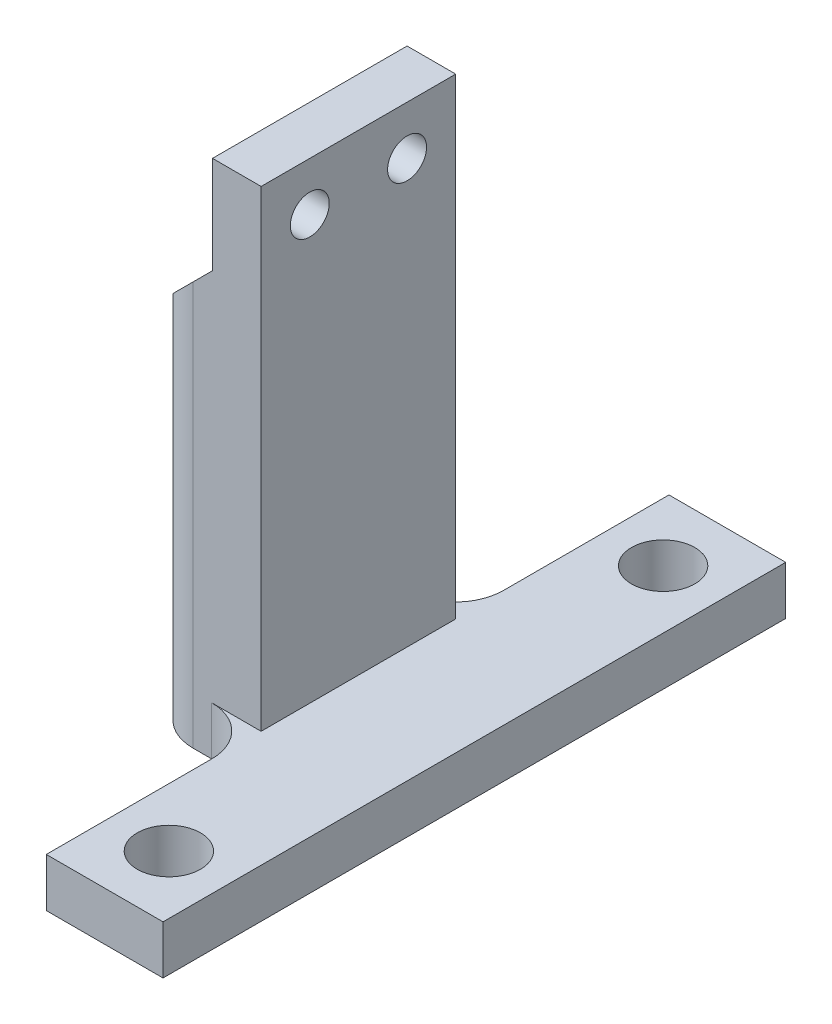
ISO-10303-21;
HEADER;
FILE_DESCRIPTION(('STEP AP214'),'2;1');
FILE_NAME('part.step','',(''),(''),'','','');
FILE_SCHEMA(('AUTOMOTIVE_DESIGN { 1 0 10303 214 1 1 1 1 }'));
ENDSEC;
DATA;
#1=APPLICATION_CONTEXT('core data for automotive mechanical design processes');
#2=APPLICATION_PROTOCOL_DEFINITION('international standard','automotive_design',2000,#1);
#3=PRODUCT_CONTEXT('',#1,'mechanical');
#4=PRODUCT('Part','Part','',(#3));
#5=PRODUCT_RELATED_PRODUCT_CATEGORY('part','',(#4));
#6=PRODUCT_DEFINITION_FORMATION('','',#4);
#7=PRODUCT_DEFINITION_CONTEXT('part definition',#1,'design');
#8=PRODUCT_DEFINITION('design','',#6,#7);
#9=PRODUCT_DEFINITION_SHAPE('','',#8);
#10=(LENGTH_UNIT() NAMED_UNIT(*) SI_UNIT(.MILLI.,.METRE.));
#11=(NAMED_UNIT(*) PLANE_ANGLE_UNIT() SI_UNIT($,.RADIAN.));
#12=(NAMED_UNIT(*) SI_UNIT($,.STERADIAN.) SOLID_ANGLE_UNIT());
#13=UNCERTAINTY_MEASURE_WITH_UNIT(LENGTH_MEASURE(1.E-05),#10,'distance_accuracy_value','');
#14=(GEOMETRIC_REPRESENTATION_CONTEXT(3) GLOBAL_UNCERTAINTY_ASSIGNED_CONTEXT((#13)) GLOBAL_UNIT_ASSIGNED_CONTEXT((#10,
#11,#12)) REPRESENTATION_CONTEXT('',''));
#15=CARTESIAN_POINT('',(0.,0.,0.));
#16=DIRECTION('',(0.,0.,1.));
#17=DIRECTION('',(1.,0.,0.));
#18=AXIS2_PLACEMENT_3D('',#15,#16,#17);
#19=CARTESIAN_POINT('',(7.,0.,0.));
#20=DIRECTION('',(1.,0.,0.));
#21=DIRECTION('',(0.,0.,-1.));
#22=AXIS2_PLACEMENT_3D('',#19,#20,#21);
#23=PLANE('',#22);
#24=CARTESIAN_POINT('',(7.,48.5,-5.));
#25=DIRECTION('',(-1.,0.,0.));
#26=DIRECTION('',(0.,0.,1.));
#27=AXIS2_PLACEMENT_3D('',#24,#25,#26);
#28=CIRCLE('',#27,2.);
#29=CARTESIAN_POINT('',(7.,48.5,-3.));
#30=VERTEX_POINT('',#29);
#31=EDGE_CURVE('E260',#30,#30,#28,.T.);
#32=ORIENTED_EDGE('',*,*,#31,.F.);
#33=EDGE_LOOP('',(#32));
#34=FACE_BOUND('',#33,.T.);
#35=DIRECTION('',(0.,-1.,0.));
#36=VECTOR('',#35,1.);
#37=CARTESIAN_POINT('',(7.,43.5,-10.));
#38=LINE('',#37,#36);
#39=CARTESIAN_POINT('',(7.,53.5,-10.));
#40=VERTEX_POINT('',#39);
#41=CARTESIAN_POINT('',(7.,43.5,-10.));
#42=VERTEX_POINT('',#41);
#43=EDGE_CURVE('E152',#40,#42,#38,.T.);
#44=ORIENTED_EDGE('',*,*,#43,.T.);
#45=DIRECTION('',(0.,0.,1.));
#46=VECTOR('',#45,1.);
#47=CARTESIAN_POINT('',(7.,43.5,-10.));
#48=LINE('',#47,#46);
#49=CARTESIAN_POINT('',(7.,43.5,10.));
#50=VERTEX_POINT('',#49);
#51=EDGE_CURVE('E165',#42,#50,#48,.T.);
#52=ORIENTED_EDGE('',*,*,#51,.T.);
#53=DIRECTION('',(0.,1.,0.));
#54=VECTOR('',#53,1.);
#55=CARTESIAN_POINT('',(7.,43.5,10.));
#56=LINE('',#55,#54);
#57=CARTESIAN_POINT('',(7.,53.5,10.));
#58=VERTEX_POINT('',#57);
#59=EDGE_CURVE('E175',#50,#58,#56,.T.);
#60=ORIENTED_EDGE('',*,*,#59,.T.);
#61=DIRECTION('',(0.,0.,-1.));
#62=VECTOR('',#61,1.);
#63=CARTESIAN_POINT('',(7.,53.5,-10.));
#64=LINE('',#63,#62);
#65=EDGE_CURVE('E168',#58,#40,#64,.T.);
#66=ORIENTED_EDGE('',*,*,#65,.T.);
#67=EDGE_LOOP('',(#44,#52,#60,#66));
#68=FACE_BOUND('',#67,.T.);
#69=CARTESIAN_POINT('',(7.,48.5,5.));
#70=DIRECTION('',(-1.,0.,0.));
#71=DIRECTION('',(0.,0.,1.));
#72=AXIS2_PLACEMENT_3D('',#69,#70,#71);
#73=CIRCLE('',#72,2.);
#74=CARTESIAN_POINT('',(7.,48.5,7.));
#75=VERTEX_POINT('',#74);
#76=EDGE_CURVE('E259',#75,#75,#73,.T.);
#77=ORIENTED_EDGE('',*,*,#76,.F.);
#78=EDGE_LOOP('',(#77));
#79=FACE_BOUND('',#78,.T.);
#80=ADVANCED_FACE('F35',(#34,#68,#79),#23,.F.);
#81=CARTESIAN_POINT('',(0.,5.,0.));
#82=DIRECTION('',(0.,-1.,0.));
#83=DIRECTION('',(0.,0.,-1.));
#84=AXIS2_PLACEMENT_3D('',#81,#82,#83);
#85=PLANE('',#84);
#86=CARTESIAN_POINT('',(17.9171764520374,5.,25.4));
#87=DIRECTION('',(0.,1.,0.));
#88=DIRECTION('',(0.,0.,1.));
#89=AXIS2_PLACEMENT_3D('',#86,#87,#88);
#90=CIRCLE('',#89,3.249999977);
#91=CARTESIAN_POINT('',(17.9171764520374,5.,28.649999977));
#92=VERTEX_POINT('',#91);
#93=EDGE_CURVE('E203',#92,#92,#90,.T.);
#94=ORIENTED_EDGE('',*,*,#93,.F.);
#95=EDGE_LOOP('',(#94));
#96=FACE_BOUND('',#95,.T.);
#97=CARTESIAN_POINT('',(17.9171764520374,5.,-25.4));
#98=DIRECTION('',(0.,1.,0.));
#99=DIRECTION('',(0.,0.,1.));
#100=AXIS2_PLACEMENT_3D('',#97,#98,#99);
#101=CIRCLE('',#100,3.249999977);
#102=CARTESIAN_POINT('',(17.9171764520374,5.,-22.150000023));
#103=VERTEX_POINT('',#102);
#104=EDGE_CURVE('E209',#103,#103,#101,.T.);
#105=ORIENTED_EDGE('',*,*,#104,.F.);
#106=EDGE_LOOP('',(#105));
#107=FACE_BOUND('',#106,.T.);
#108=DIRECTION('',(1.,0.,0.));
#109=VECTOR('',#108,1.);
#110=CARTESIAN_POINT('',(0.,5.,10.));
#111=LINE('',#110,#109);
#112=CARTESIAN_POINT('',(6.91717645203743,5.,10.));
#113=VERTEX_POINT('',#112);
#114=CARTESIAN_POINT('',(12.,5.,10.));
#115=VERTEX_POINT('',#114);
#116=EDGE_CURVE('E194',#113,#115,#111,.T.);
#117=ORIENTED_EDGE('',*,*,#116,.F.);
#118=CARTESIAN_POINT('',(6.91717645203744,5.,15.));
#119=DIRECTION('',(0.,-1.,0.));
#120=DIRECTION('',(0.,0.,-1.));
#121=AXIS2_PLACEMENT_3D('',#118,#119,#120);
#122=CIRCLE('',#121,5.);
#123=CARTESIAN_POINT('',(11.9171764520374,5.,15.));
#124=VERTEX_POINT('',#123);
#125=EDGE_CURVE('E11',#113,#124,#122,.T.);
#126=ORIENTED_EDGE('',*,*,#125,.T.);
#127=DIRECTION('',(0.,0.,1.));
#128=VECTOR('',#127,1.);
#129=CARTESIAN_POINT('',(11.9171764520374,5.,10.));
#130=LINE('',#129,#128);
#131=CARTESIAN_POINT('',(11.9171764520374,5.,32.));
#132=VERTEX_POINT('',#131);
#133=EDGE_CURVE('E226',#124,#132,#130,.T.);
#134=ORIENTED_EDGE('',*,*,#133,.T.);
#135=DIRECTION('',(1.,0.,0.));
#136=VECTOR('',#135,1.);
#137=CARTESIAN_POINT('',(11.9171764520374,5.,32.));
#138=LINE('',#137,#136);
#139=CARTESIAN_POINT('',(23.9171764520374,5.,32.));
#140=VERTEX_POINT('',#139);
#141=EDGE_CURVE('E216',#132,#140,#138,.T.);
#142=ORIENTED_EDGE('',*,*,#141,.T.);
#143=DIRECTION('',(0.,0.,-1.));
#144=VECTOR('',#143,1.);
#145=CARTESIAN_POINT('',(23.9171764520374,5.,-32.));
#146=LINE('',#145,#144);
#147=CARTESIAN_POINT('',(23.9171764520374,5.,-32.));
#148=VERTEX_POINT('',#147);
#149=EDGE_CURVE('E219',#140,#148,#146,.T.);
#150=ORIENTED_EDGE('',*,*,#149,.T.);
#151=DIRECTION('',(-1.,0.,0.));
#152=VECTOR('',#151,1.);
#153=CARTESIAN_POINT('',(11.9171764520374,5.,-32.));
#154=LINE('',#153,#152);
#155=CARTESIAN_POINT('',(11.9171764520374,5.,-32.));
#156=VERTEX_POINT('',#155);
#157=EDGE_CURVE('E222',#148,#156,#154,.T.);
#158=ORIENTED_EDGE('',*,*,#157,.T.);
#159=DIRECTION('',(0.,0.,1.));
#160=VECTOR('',#159,1.);
#161=CARTESIAN_POINT('',(11.9171764520374,5.,-32.));
#162=LINE('',#161,#160);
#163=CARTESIAN_POINT('',(11.9171764520374,5.,-15.));
#164=VERTEX_POINT('',#163);
#165=EDGE_CURVE('E224',#156,#164,#162,.T.);
#166=ORIENTED_EDGE('',*,*,#165,.T.);
#167=CARTESIAN_POINT('',(6.91717645203743,5.,-15.));
#168=DIRECTION('',(0.,-1.,0.));
#169=DIRECTION('',(0.,0.,-1.));
#170=AXIS2_PLACEMENT_3D('',#167,#168,#169);
#171=CIRCLE('',#170,5.);
#172=CARTESIAN_POINT('',(6.91717645203743,5.,-10.));
#173=VERTEX_POINT('',#172);
#174=EDGE_CURVE('E292',#164,#173,#171,.T.);
#175=ORIENTED_EDGE('',*,*,#174,.T.);
#176=DIRECTION('',(-1.,0.,0.));
#177=VECTOR('',#176,1.);
#178=CARTESIAN_POINT('',(12.,5.,-10.));
#179=LINE('',#178,#177);
#180=CARTESIAN_POINT('',(12.,5.,-10.));
#181=VERTEX_POINT('',#180);
#182=EDGE_CURVE('E186',#181,#173,#179,.T.);
#183=ORIENTED_EDGE('',*,*,#182,.F.);
#184=DIRECTION('',(0.,0.,-1.));
#185=VECTOR('',#184,1.);
#186=CARTESIAN_POINT('',(12.,5.,10.));
#187=LINE('',#186,#185);
#188=EDGE_CURVE('E181',#115,#181,#187,.T.);
#189=ORIENTED_EDGE('',*,*,#188,.F.);
#190=EDGE_LOOP('',(#117,#126,#134,#142,#150,#158,#166,#175,#183,#189));
#191=FACE_BOUND('',#190,.T.);
#192=ADVANCED_FACE('F309',(#96,#107,#191),#85,.F.);
#193=CARTESIAN_POINT('',(11.9171764520374,5.,32.));
#194=DIRECTION('',(0.,0.,-1.));
#195=DIRECTION('',(-1.,0.,0.));
#196=AXIS2_PLACEMENT_3D('',#193,#194,#195);
#197=PLANE('',#196);
#198=DIRECTION('',(1.,0.,0.));
#199=VECTOR('',#198,1.);
#200=CARTESIAN_POINT('',(11.9171764520374,0.,32.));
#201=LINE('',#200,#199);
#202=CARTESIAN_POINT('',(11.9171764520374,0.,32.));
#203=VERTEX_POINT('',#202);
#204=CARTESIAN_POINT('',(23.9171764520374,0.,32.));
#205=VERTEX_POINT('',#204);
#206=EDGE_CURVE('E215',#203,#205,#201,.T.);
#207=ORIENTED_EDGE('',*,*,#206,.T.);
#208=DIRECTION('',(0.,-1.,0.));
#209=VECTOR('',#208,1.);
#210=CARTESIAN_POINT('',(23.9171764520374,5.,32.));
#211=LINE('',#210,#209);
#212=EDGE_CURVE('E197',#140,#205,#211,.T.);
#213=ORIENTED_EDGE('',*,*,#212,.F.);
#214=ORIENTED_EDGE('',*,*,#141,.F.);
#215=DIRECTION('',(0.,-1.,0.));
#216=VECTOR('',#215,1.);
#217=CARTESIAN_POINT('',(11.9171764520374,5.,32.));
#218=LINE('',#217,#216);
#219=EDGE_CURVE('E228',#132,#203,#218,.T.);
#220=ORIENTED_EDGE('',*,*,#219,.T.);
#221=EDGE_LOOP('',(#207,#213,#214,#220));
#222=FACE_BOUND('',#221,.T.);
#223=ADVANCED_FACE('F313',(#222),#197,.F.);
#224=CARTESIAN_POINT('',(23.9171764520374,5.,-32.));
#225=DIRECTION('',(-1.,0.,0.));
#226=DIRECTION('',(0.,0.,1.));
#227=AXIS2_PLACEMENT_3D('',#224,#225,#226);
#228=PLANE('',#227);
#229=DIRECTION('',(0.,0.,-1.));
#230=VECTOR('',#229,1.);
#231=CARTESIAN_POINT('',(23.9171764520374,0.,-32.));
#232=LINE('',#231,#230);
#233=CARTESIAN_POINT('',(23.9171764520374,0.,-32.));
#234=VERTEX_POINT('',#233);
#235=EDGE_CURVE('E231',#205,#234,#232,.T.);
#236=ORIENTED_EDGE('',*,*,#235,.T.);
#237=DIRECTION('',(0.,-1.,0.));
#238=VECTOR('',#237,1.);
#239=CARTESIAN_POINT('',(23.9171764520374,5.,-32.));
#240=LINE('',#239,#238);
#241=EDGE_CURVE('E251',#148,#234,#240,.T.);
#242=ORIENTED_EDGE('',*,*,#241,.F.);
#243=ORIENTED_EDGE('',*,*,#149,.F.);
#244=ORIENTED_EDGE('',*,*,#212,.T.);
#245=EDGE_LOOP('',(#236,#242,#243,#244));
#246=FACE_BOUND('',#245,.T.);
#247=ADVANCED_FACE('F315',(#246),#228,.F.);
#248=CARTESIAN_POINT('',(11.9171764520374,5.,-32.));
#249=DIRECTION('',(0.,0.,1.));
#250=DIRECTION('',(1.,0.,0.));
#251=AXIS2_PLACEMENT_3D('',#248,#249,#250);
#252=PLANE('',#251);
#253=DIRECTION('',(-1.,0.,0.));
#254=VECTOR('',#253,1.);
#255=CARTESIAN_POINT('',(11.9171764520374,0.,-32.));
#256=LINE('',#255,#254);
#257=CARTESIAN_POINT('',(11.9171764520374,0.,-32.));
#258=VERTEX_POINT('',#257);
#259=EDGE_CURVE('E233',#234,#258,#256,.T.);
#260=ORIENTED_EDGE('',*,*,#259,.T.);
#261=DIRECTION('',(0.,-1.,0.));
#262=VECTOR('',#261,1.);
#263=CARTESIAN_POINT('',(11.9171764520374,5.,-32.));
#264=LINE('',#263,#262);
#265=EDGE_CURVE('E248',#156,#258,#264,.T.);
#266=ORIENTED_EDGE('',*,*,#265,.F.);
#267=ORIENTED_EDGE('',*,*,#157,.F.);
#268=ORIENTED_EDGE('',*,*,#241,.T.);
#269=EDGE_LOOP('',(#260,#266,#267,#268));
#270=FACE_BOUND('',#269,.T.);
#271=ADVANCED_FACE('F320',(#270),#252,.F.);
#272=CARTESIAN_POINT('',(11.9171764520374,5.,-32.));
#273=DIRECTION('',(1.,0.,0.));
#274=DIRECTION('',(0.,0.,-1.));
#275=AXIS2_PLACEMENT_3D('',#272,#273,#274);
#276=PLANE('',#275);
#277=DIRECTION('',(0.,0.,1.));
#278=VECTOR('',#277,1.);
#279=CARTESIAN_POINT('',(11.9171764520374,0.,-32.));
#280=LINE('',#279,#278);
#281=CARTESIAN_POINT('',(11.9171764520374,0.,-15.));
#282=VERTEX_POINT('',#281);
#283=EDGE_CURVE('E235',#258,#282,#280,.T.);
#284=ORIENTED_EDGE('',*,*,#283,.T.);
#285=DIRECTION('',(0.,-1.,0.));
#286=VECTOR('',#285,1.);
#287=CARTESIAN_POINT('',(11.9171764520374,5.,-15.));
#288=LINE('',#287,#286);
#289=EDGE_CURVE('E56',#282,#164,#288,.F.);
#290=ORIENTED_EDGE('',*,*,#289,.T.);
#291=ORIENTED_EDGE('',*,*,#165,.F.);
#292=ORIENTED_EDGE('',*,*,#265,.T.);
#293=EDGE_LOOP('',(#284,#290,#291,#292));
#294=FACE_BOUND('',#293,.T.);
#295=ADVANCED_FACE('F386',(#294),#276,.F.);
#296=CARTESIAN_POINT('',(11.9171764520374,5.,-10.));
#297=DIRECTION('',(0.,0.,1.));
#298=DIRECTION('',(1.,0.,0.));
#299=AXIS2_PLACEMENT_3D('',#296,#297,#298);
#300=PLANE('',#299);
#301=DIRECTION('',(-1.,0.,0.));
#302=VECTOR('',#301,1.);
#303=CARTESIAN_POINT('',(11.9171764520374,0.,-10.));
#304=LINE('',#303,#302);
#305=CARTESIAN_POINT('',(6.91717645203743,0.,-10.));
#306=VERTEX_POINT('',#305);
#307=CARTESIAN_POINT('',(5.,0.,-10.));
#308=VERTEX_POINT('',#307);
#309=EDGE_CURVE('E237',#306,#308,#304,.T.);
#310=ORIENTED_EDGE('',*,*,#309,.T.);
#311=DIRECTION('',(0.,-1.,0.));
#312=VECTOR('',#311,1.);
#313=CARTESIAN_POINT('',(5.,5.,-10.));
#314=LINE('',#313,#312);
#315=CARTESIAN_POINT('',(4.99999999999999,41.5,-10.));
#316=VERTEX_POINT('',#315);
#317=EDGE_CURVE('E155',#308,#316,#314,.F.);
#318=ORIENTED_EDGE('',*,*,#317,.T.);
#319=DIRECTION('',(-0.707106781186546,-0.707106781186549,0.));
#320=VECTOR('',#319,1.);
#321=CARTESIAN_POINT('',(7.,43.5,-10.));
#322=LINE('',#321,#320);
#323=EDGE_CURVE('E148',#316,#42,#322,.F.);
#324=ORIENTED_EDGE('',*,*,#323,.T.);
#325=ORIENTED_EDGE('',*,*,#43,.F.);
#326=DIRECTION('',(-1.,0.,0.));
#327=VECTOR('',#326,1.);
#328=CARTESIAN_POINT('',(12.,53.5,-10.));
#329=LINE('',#328,#327);
#330=CARTESIAN_POINT('',(12.,53.5,-10.));
#331=VERTEX_POINT('',#330);
#332=EDGE_CURVE('E185',#331,#40,#329,.T.);
#333=ORIENTED_EDGE('',*,*,#332,.F.);
#334=DIRECTION('',(0.,-1.,0.));
#335=VECTOR('',#334,1.);
#336=CARTESIAN_POINT('',(12.,53.5,-10.));
#337=LINE('',#336,#335);
#338=EDGE_CURVE('E200',#331,#181,#337,.T.);
#339=ORIENTED_EDGE('',*,*,#338,.T.);
#340=ORIENTED_EDGE('',*,*,#182,.T.);
#341=DIRECTION('',(0.,-1.,0.));
#342=VECTOR('',#341,1.);
#343=CARTESIAN_POINT('',(6.91717645203743,0.,-10.));
#344=LINE('',#343,#342);
#345=EDGE_CURVE('E282',#173,#306,#344,.T.);
#346=ORIENTED_EDGE('',*,*,#345,.T.);
#347=EDGE_LOOP('',(#310,#318,#324,#325,#333,#339,#340,#346));
#348=FACE_BOUND('',#347,.T.);
#349=ADVANCED_FACE('F151',(#348),#300,.F.);
#350=CARTESIAN_POINT('',(0.,5.,10.));
#351=DIRECTION('',(1.,0.,0.));
#352=DIRECTION('',(0.,0.,-1.));
#353=AXIS2_PLACEMENT_3D('',#350,#351,#352);
#354=PLANE('',#353);
#355=DIRECTION('',(0.,0.,1.));
#356=VECTOR('',#355,1.);
#357=CARTESIAN_POINT('',(0.,0.,10.));
#358=LINE('',#357,#356);
#359=CARTESIAN_POINT('',(0.,0.,-5.));
#360=VERTEX_POINT('',#359);
#361=CARTESIAN_POINT('',(0.,0.,5.));
#362=VERTEX_POINT('',#361);
#363=EDGE_CURVE('E239',#360,#362,#358,.T.);
#364=ORIENTED_EDGE('',*,*,#363,.T.);
#365=DIRECTION('',(0.,-1.,0.));
#366=VECTOR('',#365,1.);
#367=CARTESIAN_POINT('',(0.,5.,5.));
#368=LINE('',#367,#366);
#369=CARTESIAN_POINT('',(0.,36.5,5.));
#370=VERTEX_POINT('',#369);
#371=EDGE_CURVE('E276',#362,#370,#368,.F.);
#372=ORIENTED_EDGE('',*,*,#371,.T.);
#373=DIRECTION('',(0.,0.,-1.));
#374=VECTOR('',#373,1.);
#375=CARTESIAN_POINT('',(0.,36.5,10.));
#376=LINE('',#375,#374);
#377=CARTESIAN_POINT('',(0.,36.5,-5.));
#378=VERTEX_POINT('',#377);
#379=EDGE_CURVE('E160',#370,#378,#376,.T.);
#380=ORIENTED_EDGE('',*,*,#379,.T.);
#381=DIRECTION('',(0.,-1.,0.));
#382=VECTOR('',#381,1.);
#383=CARTESIAN_POINT('',(0.,5.,-5.));
#384=LINE('',#383,#382);
#385=EDGE_CURVE('E273',#378,#360,#384,.T.);
#386=ORIENTED_EDGE('',*,*,#385,.T.);
#387=EDGE_LOOP('',(#364,#372,#380,#386));
#388=FACE_BOUND('',#387,.T.);
#389=ADVANCED_FACE('F332',(#388),#354,.F.);
#390=CARTESIAN_POINT('',(11.9171764520374,5.,10.));
#391=DIRECTION('',(0.,0.,-1.));
#392=DIRECTION('',(-1.,0.,0.));
#393=AXIS2_PLACEMENT_3D('',#390,#391,#392);
#394=PLANE('',#393);
#395=DIRECTION('',(0.707106781186546,0.707106781186549,0.));
#396=VECTOR('',#395,1.);
#397=CARTESIAN_POINT('',(7.00000000000001,43.5,10.));
#398=LINE('',#397,#396);
#399=CARTESIAN_POINT('',(5.,41.5,10.));
#400=VERTEX_POINT('',#399);
#401=EDGE_CURVE('E174',#50,#400,#398,.F.);
#402=ORIENTED_EDGE('',*,*,#401,.T.);
#403=DIRECTION('',(0.,-1.,0.));
#404=VECTOR('',#403,1.);
#405=CARTESIAN_POINT('',(5.,5.,10.));
#406=LINE('',#405,#404);
#407=CARTESIAN_POINT('',(5.,0.,10.));
#408=VERTEX_POINT('',#407);
#409=EDGE_CURVE('E266',#400,#408,#406,.T.);
#410=ORIENTED_EDGE('',*,*,#409,.T.);
#411=DIRECTION('',(1.,0.,0.));
#412=VECTOR('',#411,1.);
#413=CARTESIAN_POINT('',(11.9171764520374,0.,10.));
#414=LINE('',#413,#412);
#415=CARTESIAN_POINT('',(6.91717645203743,0.,10.));
#416=VERTEX_POINT('',#415);
#417=EDGE_CURVE('E242',#408,#416,#414,.T.);
#418=ORIENTED_EDGE('',*,*,#417,.T.);
#419=DIRECTION('',(0.,-1.,0.));
#420=VECTOR('',#419,1.);
#421=CARTESIAN_POINT('',(6.91717645203743,5.,10.));
#422=LINE('',#421,#420);
#423=EDGE_CURVE('E159',#416,#113,#422,.F.);
#424=ORIENTED_EDGE('',*,*,#423,.T.);
#425=ORIENTED_EDGE('',*,*,#116,.T.);
#426=DIRECTION('',(0.,-1.,0.));
#427=VECTOR('',#426,1.);
#428=CARTESIAN_POINT('',(12.,53.5,10.));
#429=LINE('',#428,#427);
#430=CARTESIAN_POINT('',(12.,53.5,10.));
#431=VERTEX_POINT('',#430);
#432=EDGE_CURVE('E190',#431,#115,#429,.T.);
#433=ORIENTED_EDGE('',*,*,#432,.F.);
#434=DIRECTION('',(1.,0.,0.));
#435=VECTOR('',#434,1.);
#436=CARTESIAN_POINT('',(0.,53.5,10.));
#437=LINE('',#436,#435);
#438=EDGE_CURVE('E188',#58,#431,#437,.T.);
#439=ORIENTED_EDGE('',*,*,#438,.F.);
#440=ORIENTED_EDGE('',*,*,#59,.F.);
#441=EDGE_LOOP('',(#402,#410,#418,#424,#425,#433,#439,#440));
#442=FACE_BOUND('',#441,.T.);
#443=ADVANCED_FACE('F303',(#442),#394,.F.);
#444=CARTESIAN_POINT('',(11.9171764520374,5.,10.));
#445=DIRECTION('',(1.,0.,0.));
#446=DIRECTION('',(0.,0.,-1.));
#447=AXIS2_PLACEMENT_3D('',#444,#445,#446);
#448=PLANE('',#447);
#449=ORIENTED_EDGE('',*,*,#133,.F.);
#450=DIRECTION('',(0.,-1.,0.));
#451=VECTOR('',#450,1.);
#452=CARTESIAN_POINT('',(11.9171764520374,0.,15.));
#453=LINE('',#452,#451);
#454=CARTESIAN_POINT('',(11.9171764520374,0.,15.));
#455=VERTEX_POINT('',#454);
#456=EDGE_CURVE('E287',#124,#455,#453,.T.);
#457=ORIENTED_EDGE('',*,*,#456,.T.);
#458=DIRECTION('',(0.,0.,1.));
#459=VECTOR('',#458,1.);
#460=CARTESIAN_POINT('',(11.9171764520374,0.,10.));
#461=LINE('',#460,#459);
#462=EDGE_CURVE('E220',#455,#203,#461,.T.);
#463=ORIENTED_EDGE('',*,*,#462,.T.);
#464=ORIENTED_EDGE('',*,*,#219,.F.);
#465=EDGE_LOOP('',(#449,#457,#463,#464));
#466=FACE_BOUND('',#465,.T.);
#467=ADVANCED_FACE('F306',(#466),#448,.F.);
#468=CARTESIAN_POINT('',(0.,0.,0.));
#469=DIRECTION('',(0.,-1.,0.));
#470=DIRECTION('',(0.,0.,-1.));
#471=AXIS2_PLACEMENT_3D('',#468,#469,#470);
#472=PLANE('',#471);
#473=CARTESIAN_POINT('',(17.9171764520374,0.,25.4));
#474=DIRECTION('',(0.,1.,0.));
#475=DIRECTION('',(0.,0.,1.));
#476=AXIS2_PLACEMENT_3D('',#473,#474,#475);
#477=CIRCLE('',#476,3.249999977);
#478=CARTESIAN_POINT('',(17.9171764520374,0.,28.649999977));
#479=VERTEX_POINT('',#478);
#480=EDGE_CURVE('E206',#479,#479,#477,.T.);
#481=ORIENTED_EDGE('',*,*,#480,.T.);
#482=EDGE_LOOP('',(#481));
#483=FACE_BOUND('',#482,.T.);
#484=CARTESIAN_POINT('',(17.9171764520374,0.,-25.4));
#485=DIRECTION('',(0.,1.,0.));
#486=DIRECTION('',(0.,0.,1.));
#487=AXIS2_PLACEMENT_3D('',#484,#485,#486);
#488=CIRCLE('',#487,3.249999977);
#489=CARTESIAN_POINT('',(17.9171764520374,0.,-22.150000023));
#490=VERTEX_POINT('',#489);
#491=EDGE_CURVE('E212',#490,#490,#488,.T.);
#492=ORIENTED_EDGE('',*,*,#491,.T.);
#493=EDGE_LOOP('',(#492));
#494=FACE_BOUND('',#493,.T.);
#495=ORIENTED_EDGE('',*,*,#417,.F.);
#496=CARTESIAN_POINT('',(5.,0.,5.));
#497=DIRECTION('',(0.,-1.,0.));
#498=DIRECTION('',(0.,0.,-1.));
#499=AXIS2_PLACEMENT_3D('',#496,#497,#498);
#500=CIRCLE('',#499,5.);
#501=EDGE_CURVE('E271',#408,#362,#500,.T.);
#502=ORIENTED_EDGE('',*,*,#501,.T.);
#503=ORIENTED_EDGE('',*,*,#363,.F.);
#504=CARTESIAN_POINT('',(5.,0.,-5.));
#505=DIRECTION('',(0.,-1.,0.));
#506=DIRECTION('',(0.,0.,-1.));
#507=AXIS2_PLACEMENT_3D('',#504,#505,#506);
#508=CIRCLE('',#507,5.);
#509=EDGE_CURVE('E269',#360,#308,#508,.T.);
#510=ORIENTED_EDGE('',*,*,#509,.T.);
#511=ORIENTED_EDGE('',*,*,#309,.F.);
#512=CARTESIAN_POINT('',(6.91717645203743,0.,-15.));
#513=DIRECTION('',(0.,-1.,0.));
#514=DIRECTION('',(0.,0.,-1.));
#515=AXIS2_PLACEMENT_3D('',#512,#513,#514);
#516=CIRCLE('',#515,5.);
#517=EDGE_CURVE('E290',#306,#282,#516,.F.);
#518=ORIENTED_EDGE('',*,*,#517,.T.);
#519=ORIENTED_EDGE('',*,*,#283,.F.);
#520=ORIENTED_EDGE('',*,*,#259,.F.);
#521=ORIENTED_EDGE('',*,*,#235,.F.);
#522=ORIENTED_EDGE('',*,*,#206,.F.);
#523=ORIENTED_EDGE('',*,*,#462,.F.);
#524=CARTESIAN_POINT('',(6.91717645203744,0.,15.));
#525=DIRECTION('',(0.,-1.,0.));
#526=DIRECTION('',(0.,0.,-1.));
#527=AXIS2_PLACEMENT_3D('',#524,#525,#526);
#528=CIRCLE('',#527,5.);
#529=EDGE_CURVE('E43',#455,#416,#528,.F.);
#530=ORIENTED_EDGE('',*,*,#529,.T.);
#531=EDGE_LOOP('',(#495,#502,#503,#510,#511,#518,#519,#520,#521,#522,#523,#530));
#532=FACE_BOUND('',#531,.T.);
#533=ADVANCED_FACE('F297',(#483,#494,#532),#472,.T.);
#534=CARTESIAN_POINT('',(17.9171764520374,5.,-25.4));
#535=DIRECTION('',(0.,1.,0.));
#536=DIRECTION('',(0.,0.,1.));
#537=AXIS2_PLACEMENT_3D('',#534,#535,#536);
#538=CYLINDRICAL_SURFACE('',#537,3.249999977);
#539=ORIENTED_EDGE('',*,*,#491,.F.);
#540=EDGE_LOOP('',(#539));
#541=FACE_BOUND('',#540,.T.);
#542=ORIENTED_EDGE('',*,*,#104,.T.);
#543=EDGE_LOOP('',(#542));
#544=FACE_BOUND('',#543,.T.);
#545=ADVANCED_FACE('F370',(#541,#544),#538,.F.);
#546=CARTESIAN_POINT('',(17.9171764520374,5.,25.4));
#547=DIRECTION('',(0.,1.,0.));
#548=DIRECTION('',(0.,0.,1.));
#549=AXIS2_PLACEMENT_3D('',#546,#547,#548);
#550=CYLINDRICAL_SURFACE('',#549,3.249999977);
#551=ORIENTED_EDGE('',*,*,#480,.F.);
#552=EDGE_LOOP('',(#551));
#553=FACE_BOUND('',#552,.T.);
#554=ORIENTED_EDGE('',*,*,#93,.T.);
#555=EDGE_LOOP('',(#554));
#556=FACE_BOUND('',#555,.T.);
#557=ADVANCED_FACE('F366',(#553,#556),#550,.F.);
#558=CARTESIAN_POINT('',(12.,53.5,10.));
#559=DIRECTION('',(-1.,0.,0.));
#560=DIRECTION('',(0.,0.,1.));
#561=AXIS2_PLACEMENT_3D('',#558,#559,#560);
#562=PLANE('',#561);
#563=CARTESIAN_POINT('',(12.,48.5,-5.));
#564=DIRECTION('',(-1.,0.,0.));
#565=DIRECTION('',(0.,0.,1.));
#566=AXIS2_PLACEMENT_3D('',#563,#564,#565);
#567=CIRCLE('',#566,2.);
#568=CARTESIAN_POINT('',(12.,48.5,-3.));
#569=VERTEX_POINT('',#568);
#570=EDGE_CURVE('E256',#569,#569,#567,.T.);
#571=ORIENTED_EDGE('',*,*,#570,.T.);
#572=EDGE_LOOP('',(#571));
#573=FACE_BOUND('',#572,.T.);
#574=CARTESIAN_POINT('',(12.,48.5,5.));
#575=DIRECTION('',(-1.,0.,0.));
#576=DIRECTION('',(0.,0.,1.));
#577=AXIS2_PLACEMENT_3D('',#574,#575,#576);
#578=CIRCLE('',#577,2.);
#579=CARTESIAN_POINT('',(12.,48.5,7.));
#580=VERTEX_POINT('',#579);
#581=EDGE_CURVE('E169',#580,#580,#578,.T.);
#582=ORIENTED_EDGE('',*,*,#581,.T.);
#583=EDGE_LOOP('',(#582));
#584=FACE_BOUND('',#583,.T.);
#585=ORIENTED_EDGE('',*,*,#188,.T.);
#586=ORIENTED_EDGE('',*,*,#338,.F.);
#587=DIRECTION('',(0.,0.,-1.));
#588=VECTOR('',#587,1.);
#589=CARTESIAN_POINT('',(12.,53.5,10.));
#590=LINE('',#589,#588);
#591=EDGE_CURVE('E182',#431,#331,#590,.T.);
#592=ORIENTED_EDGE('',*,*,#591,.F.);
#593=ORIENTED_EDGE('',*,*,#432,.T.);
#594=EDGE_LOOP('',(#585,#586,#592,#593));
#595=FACE_BOUND('',#594,.T.);
#596=ADVANCED_FACE('F362',(#573,#584,#595),#562,.F.);
#597=CARTESIAN_POINT('',(0.,53.5,0.));
#598=DIRECTION('',(0.,1.,0.));
#599=DIRECTION('',(0.,0.,1.));
#600=AXIS2_PLACEMENT_3D('',#597,#598,#599);
#601=PLANE('',#600);
#602=ORIENTED_EDGE('',*,*,#65,.F.);
#603=ORIENTED_EDGE('',*,*,#438,.T.);
#604=ORIENTED_EDGE('',*,*,#591,.T.);
#605=ORIENTED_EDGE('',*,*,#332,.T.);
#606=EDGE_LOOP('',(#602,#603,#604,#605));
#607=FACE_BOUND('',#606,.T.);
#608=ADVANCED_FACE('F359',(#607),#601,.T.);
#609=CARTESIAN_POINT('',(7.,48.5,5.));
#610=DIRECTION('',(-1.,0.,0.));
#611=DIRECTION('',(0.,0.,1.));
#612=AXIS2_PLACEMENT_3D('',#609,#610,#611);
#613=CYLINDRICAL_SURFACE('',#612,2.);
#614=ORIENTED_EDGE('',*,*,#76,.T.);
#615=EDGE_LOOP('',(#614));
#616=FACE_BOUND('',#615,.T.);
#617=ORIENTED_EDGE('',*,*,#581,.F.);
#618=EDGE_LOOP('',(#617));
#619=FACE_BOUND('',#618,.T.);
#620=ADVANCED_FACE('F357',(#616,#619),#613,.F.);
#621=CARTESIAN_POINT('',(7.,48.5,-5.));
#622=DIRECTION('',(-1.,0.,0.));
#623=DIRECTION('',(0.,0.,1.));
#624=AXIS2_PLACEMENT_3D('',#621,#622,#623);
#625=CYLINDRICAL_SURFACE('',#624,2.);
#626=ORIENTED_EDGE('',*,*,#31,.T.);
#627=EDGE_LOOP('',(#626));
#628=FACE_BOUND('',#627,.T.);
#629=ORIENTED_EDGE('',*,*,#570,.F.);
#630=EDGE_LOOP('',(#629));
#631=FACE_BOUND('',#630,.T.);
#632=ADVANCED_FACE('F344',(#628,#631),#625,.F.);
#633=CARTESIAN_POINT('',(7.,43.5,-10.));
#634=DIRECTION('',(0.707106781186549,-0.707106781186546,0.));
#635=DIRECTION('',(0.,0.,1.));
#636=AXIS2_PLACEMENT_3D('',#633,#634,#635);
#637=PLANE('',#636);
#638=ORIENTED_EDGE('',*,*,#379,.F.);
#639=CARTESIAN_POINT('',(5.,41.5,5.));
#640=DIRECTION('',(0.707106781186549,-0.707106781186546,0.));
#641=DIRECTION('',(-0.707106781186546,-0.707106781186549,0.));
#642=AXIS2_PLACEMENT_3D('',#639,#640,#641);
#643=ELLIPSE('',#642,7.07106781186549,5.);
#644=EDGE_CURVE('E280',#370,#400,#643,.F.);
#645=ORIENTED_EDGE('',*,*,#644,.T.);
#646=ORIENTED_EDGE('',*,*,#401,.F.);
#647=ORIENTED_EDGE('',*,*,#51,.F.);
#648=ORIENTED_EDGE('',*,*,#323,.F.);
#649=CARTESIAN_POINT('',(5.,41.5,-5.));
#650=DIRECTION('',(0.707106781186549,-0.707106781186546,0.));
#651=DIRECTION('',(-0.707106781186546,-0.707106781186549,0.));
#652=AXIS2_PLACEMENT_3D('',#649,#650,#651);
#653=ELLIPSE('',#652,7.07106781186549,5.);
#654=EDGE_CURVE('E278',#316,#378,#653,.F.);
#655=ORIENTED_EDGE('',*,*,#654,.T.);
#656=EDGE_LOOP('',(#638,#645,#646,#647,#648,#655));
#657=FACE_BOUND('',#656,.T.);
#658=ADVANCED_FACE('F172',(#657),#637,.F.);
#659=CARTESIAN_POINT('',(5.,5.,5.));
#660=DIRECTION('',(0.,-1.,0.));
#661=DIRECTION('',(0.,0.,-1.));
#662=AXIS2_PLACEMENT_3D('',#659,#660,#661);
#663=CYLINDRICAL_SURFACE('',#662,5.);
#664=ORIENTED_EDGE('',*,*,#644,.F.);
#665=ORIENTED_EDGE('',*,*,#371,.F.);
#666=ORIENTED_EDGE('',*,*,#501,.F.);
#667=ORIENTED_EDGE('',*,*,#409,.F.);
#668=EDGE_LOOP('',(#664,#665,#666,#667));
#669=FACE_BOUND('',#668,.T.);
#670=ADVANCED_FACE('F336',(#669),#663,.T.);
#671=CARTESIAN_POINT('',(5.,5.,-5.));
#672=DIRECTION('',(0.,-1.,0.));
#673=DIRECTION('',(0.,0.,-1.));
#674=AXIS2_PLACEMENT_3D('',#671,#672,#673);
#675=CYLINDRICAL_SURFACE('',#674,5.);
#676=ORIENTED_EDGE('',*,*,#654,.F.);
#677=ORIENTED_EDGE('',*,*,#317,.F.);
#678=ORIENTED_EDGE('',*,*,#509,.F.);
#679=ORIENTED_EDGE('',*,*,#385,.F.);
#680=EDGE_LOOP('',(#676,#677,#678,#679));
#681=FACE_BOUND('',#680,.T.);
#682=ADVANCED_FACE('F330',(#681),#675,.T.);
#683=CARTESIAN_POINT('',(6.91717645203743,5.,-15.));
#684=DIRECTION('',(0.,1.,0.));
#685=DIRECTION('',(0.,0.,1.));
#686=AXIS2_PLACEMENT_3D('',#683,#684,#685);
#687=CYLINDRICAL_SURFACE('',#686,5.);
#688=ORIENTED_EDGE('',*,*,#174,.F.);
#689=ORIENTED_EDGE('',*,*,#289,.F.);
#690=ORIENTED_EDGE('',*,*,#517,.F.);
#691=ORIENTED_EDGE('',*,*,#345,.F.);
#692=EDGE_LOOP('',(#688,#689,#690,#691));
#693=FACE_BOUND('',#692,.T.);
#694=ADVANCED_FACE('F324',(#693),#687,.F.);
#695=CARTESIAN_POINT('',(6.91717645203744,5.,15.));
#696=DIRECTION('',(0.,1.,0.));
#697=DIRECTION('',(0.,0.,1.));
#698=AXIS2_PLACEMENT_3D('',#695,#696,#697);
#699=CYLINDRICAL_SURFACE('',#698,5.);
#700=ORIENTED_EDGE('',*,*,#125,.F.);
#701=ORIENTED_EDGE('',*,*,#423,.F.);
#702=ORIENTED_EDGE('',*,*,#529,.F.);
#703=ORIENTED_EDGE('',*,*,#456,.F.);
#704=EDGE_LOOP('',(#700,#701,#702,#703));
#705=FACE_BOUND('',#704,.T.);
#706=ADVANCED_FACE('F37',(#705),#699,.F.);
#707=CLOSED_SHELL('',(#80,#192,#223,#247,#271,#295,#349,#389,#443,#467,#533,#545,#557,#596,#608,
#620,#632,#658,#670,#682,#694,#706));
#708=MANIFOLD_SOLID_BREP('B2',#707);
#709=ADVANCED_BREP_SHAPE_REPRESENTATION('',(#18,#708),#14);
#710=SHAPE_DEFINITION_REPRESENTATION(#9,#709);
ENDSEC;
END-ISO-10303-21;
